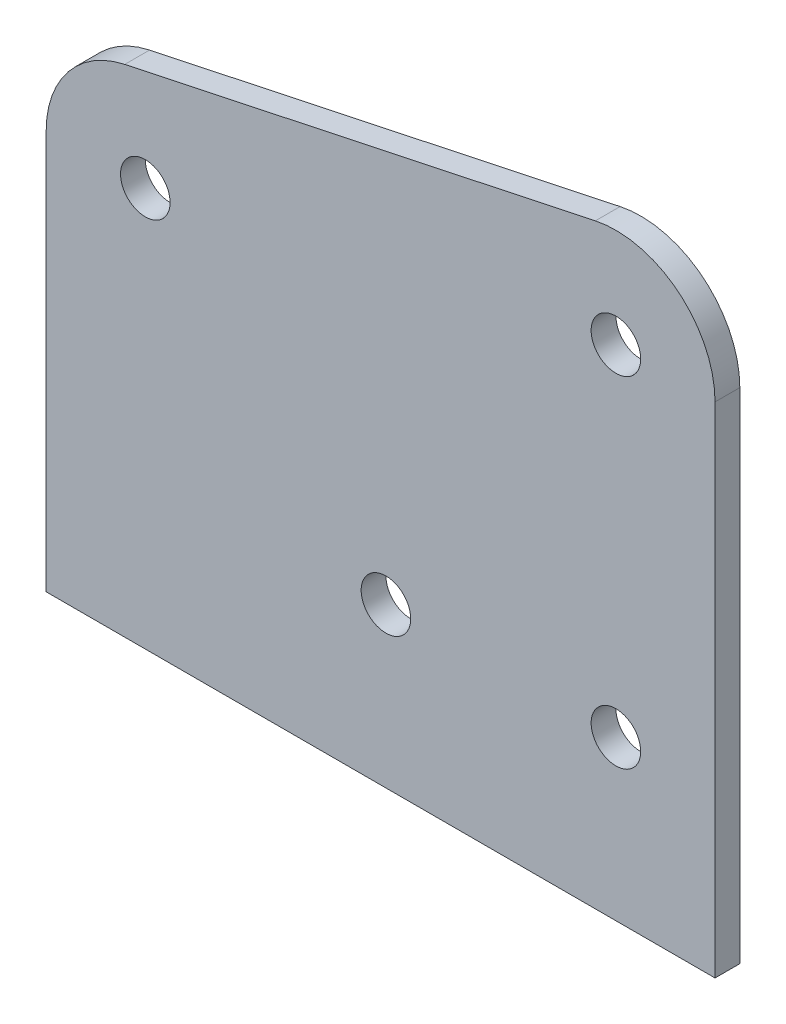
ISO-10303-21;
HEADER;
FILE_DESCRIPTION(('STEP AP214'),'2;1');
FILE_NAME('part.step','',(''),(''),'','','');
FILE_SCHEMA(('AUTOMOTIVE_DESIGN { 1 0 10303 214 1 1 1 1 }'));
ENDSEC;
DATA;
#1=APPLICATION_CONTEXT('core data for automotive mechanical design processes');
#2=APPLICATION_PROTOCOL_DEFINITION('international standard','automotive_design',2000,#1);
#3=PRODUCT_CONTEXT('',#1,'mechanical');
#4=PRODUCT('Part','Part','',(#3));
#5=PRODUCT_RELATED_PRODUCT_CATEGORY('part','',(#4));
#6=PRODUCT_DEFINITION_FORMATION('','',#4);
#7=PRODUCT_DEFINITION_CONTEXT('part definition',#1,'design');
#8=PRODUCT_DEFINITION('design','',#6,#7);
#9=PRODUCT_DEFINITION_SHAPE('','',#8);
#10=(LENGTH_UNIT() NAMED_UNIT(*) SI_UNIT(.MILLI.,.METRE.));
#11=(NAMED_UNIT(*) PLANE_ANGLE_UNIT() SI_UNIT($,.RADIAN.));
#12=(NAMED_UNIT(*) SI_UNIT($,.STERADIAN.) SOLID_ANGLE_UNIT());
#13=UNCERTAINTY_MEASURE_WITH_UNIT(LENGTH_MEASURE(1.E-05),#10,'distance_accuracy_value','');
#14=(GEOMETRIC_REPRESENTATION_CONTEXT(3) GLOBAL_UNCERTAINTY_ASSIGNED_CONTEXT((#13)) GLOBAL_UNIT_ASSIGNED_CONTEXT((#10,
#11,#12)) REPRESENTATION_CONTEXT('',''));
#15=CARTESIAN_POINT('',(0.,0.,0.));
#16=DIRECTION('',(0.,0.,1.));
#17=DIRECTION('',(1.,0.,0.));
#18=AXIS2_PLACEMENT_3D('',#15,#16,#17);
#19=CARTESIAN_POINT('',(20.6876756424581,63.91783,3.175));
#20=DIRECTION('',(0.,0.,1.));
#21=DIRECTION('',(1.,0.,0.));
#22=AXIS2_PLACEMENT_3D('',#19,#20,#21);
#23=PLANE('',#22);
#24=CARTESIAN_POINT('',(-8.77632435754189,20.35683,3.175));
#25=DIRECTION('',(0.,0.,1.));
#26=DIRECTION('',(1.,0.,0.));
#27=AXIS2_PLACEMENT_3D('',#24,#25,#26);
#28=CIRCLE('',#27,3.175);
#29=CARTESIAN_POINT('',(-5.60132435754189,20.35683,3.175));
#30=VERTEX_POINT('',#29);
#31=EDGE_CURVE('E216',#30,#30,#28,.T.);
#32=ORIENTED_EDGE('',*,*,#31,.F.);
#33=EDGE_LOOP('',(#32));
#34=FACE_BOUND('',#33,.T.);
#35=CARTESIAN_POINT('',(20.6876756424581,20.35683,3.175));
#36=DIRECTION('',(0.,0.,1.));
#37=DIRECTION('',(1.,0.,0.));
#38=AXIS2_PLACEMENT_3D('',#35,#36,#37);
#39=CIRCLE('',#38,3.175);
#40=CARTESIAN_POINT('',(23.8626756424581,20.35683,3.175));
#41=VERTEX_POINT('',#40);
#42=EDGE_CURVE('E138',#41,#41,#39,.T.);
#43=ORIENTED_EDGE('',*,*,#42,.F.);
#44=EDGE_LOOP('',(#43));
#45=FACE_BOUND('',#44,.T.);
#46=CARTESIAN_POINT('',(20.6876756424581,63.91783,3.175));
#47=DIRECTION('',(0.,0.,1.));
#48=DIRECTION('',(1.,0.,0.));
#49=AXIS2_PLACEMENT_3D('',#46,#47,#48);
#50=CIRCLE('',#49,12.7);
#51=CARTESIAN_POINT('',(33.3876756424581,63.91783,3.175));
#52=VERTEX_POINT('',#51);
#53=CARTESIAN_POINT('',(18.0529367853964,76.3415231367081,3.175));
#54=VERTEX_POINT('',#53);
#55=EDGE_CURVE('E150',#52,#54,#50,.T.);
#56=ORIENTED_EDGE('',*,*,#55,.T.);
#57=DIRECTION('',(-0.978243554071508,-0.207459752524545,0.));
#58=VECTOR('',#57,1.);
#59=CARTESIAN_POINT('',(18.0529367853964,76.3415231367081,3.175));
#60=LINE('',#59,#58);
#61=CARTESIAN_POINT('',(-42.2403132146036,63.5549091367081,3.175));
#62=VERTEX_POINT('',#61);
#63=EDGE_CURVE('E98',#54,#62,#60,.T.);
#64=ORIENTED_EDGE('',*,*,#63,.T.);
#65=CARTESIAN_POINT('',(-39.6055743575419,51.131216,3.175));
#66=DIRECTION('',(0.,0.,1.));
#67=DIRECTION('',(1.,0.,0.));
#68=AXIS2_PLACEMENT_3D('',#65,#66,#67);
#69=CIRCLE('',#68,12.7);
#70=CARTESIAN_POINT('',(-52.3055743575419,51.131216,3.175));
#71=VERTEX_POINT('',#70);
#72=EDGE_CURVE('E111',#62,#71,#69,.T.);
#73=ORIENTED_EDGE('',*,*,#72,.T.);
#74=DIRECTION('',(0.,-1.,0.));
#75=VECTOR('',#74,1.);
#76=CARTESIAN_POINT('',(-52.3055743575419,51.131216,3.175));
#77=LINE('',#76,#75);
#78=CARTESIAN_POINT('',(-52.3055743575419,0.,3.175));
#79=VERTEX_POINT('',#78);
#80=EDGE_CURVE('E105',#71,#79,#77,.T.);
#81=ORIENTED_EDGE('',*,*,#80,.T.);
#82=DIRECTION('',(1.,0.,0.));
#83=VECTOR('',#82,1.);
#84=CARTESIAN_POINT('',(-52.3055743575419,0.,3.175));
#85=LINE('',#84,#83);
#86=CARTESIAN_POINT('',(33.3876756424581,0.,3.175));
#87=VERTEX_POINT('',#86);
#88=EDGE_CURVE('E109',#79,#87,#85,.T.);
#89=ORIENTED_EDGE('',*,*,#88,.T.);
#90=DIRECTION('',(0.,1.,0.));
#91=VECTOR('',#90,1.);
#92=CARTESIAN_POINT('',(33.3876756424581,63.91783,3.175));
#93=LINE('',#92,#91);
#94=EDGE_CURVE('E61',#87,#52,#93,.T.);
#95=ORIENTED_EDGE('',*,*,#94,.T.);
#96=EDGE_LOOP('',(#56,#64,#73,#81,#89,#95));
#97=FACE_BOUND('',#96,.T.);
#98=CARTESIAN_POINT('',(20.6876756424581,63.91783,3.175));
#99=DIRECTION('',(0.,0.,1.));
#100=DIRECTION('',(1.,0.,0.));
#101=AXIS2_PLACEMENT_3D('',#98,#99,#100);
#102=CIRCLE('',#101,3.175);
#103=CARTESIAN_POINT('',(23.8626756424581,63.91783,3.175));
#104=VERTEX_POINT('',#103);
#105=EDGE_CURVE('E224',#104,#104,#102,.T.);
#106=ORIENTED_EDGE('',*,*,#105,.F.);
#107=EDGE_LOOP('',(#106));
#108=FACE_BOUND('',#107,.T.);
#109=CARTESIAN_POINT('',(-39.6055743575419,51.131216,3.175));
#110=DIRECTION('',(0.,0.,1.));
#111=DIRECTION('',(1.,0.,0.));
#112=AXIS2_PLACEMENT_3D('',#109,#110,#111);
#113=CIRCLE('',#112,3.175);
#114=CARTESIAN_POINT('',(-36.4305743575419,51.131216,3.175));
#115=VERTEX_POINT('',#114);
#116=EDGE_CURVE('E205',#115,#115,#113,.T.);
#117=ORIENTED_EDGE('',*,*,#116,.F.);
#118=EDGE_LOOP('',(#117));
#119=FACE_BOUND('',#118,.T.);
#120=ADVANCED_FACE('F43',(#34,#45,#97,#108,#119),#23,.T.);
#121=CARTESIAN_POINT('',(20.6876756424581,63.91783,0.));
#122=DIRECTION('',(0.,0.,1.));
#123=DIRECTION('',(1.,0.,0.));
#124=AXIS2_PLACEMENT_3D('',#121,#122,#123);
#125=PLANE('',#124);
#126=CARTESIAN_POINT('',(20.6876756424581,63.91783,0.));
#127=DIRECTION('',(0.,0.,1.));
#128=DIRECTION('',(1.,0.,0.));
#129=AXIS2_PLACEMENT_3D('',#126,#127,#128);
#130=CIRCLE('',#129,12.7);
#131=CARTESIAN_POINT('',(33.3876756424581,63.91783,0.));
#132=VERTEX_POINT('',#131);
#133=CARTESIAN_POINT('',(18.0529367853964,76.3415231367081,0.));
#134=VERTEX_POINT('',#133);
#135=EDGE_CURVE('E133',#132,#134,#130,.T.);
#136=ORIENTED_EDGE('',*,*,#135,.F.);
#137=DIRECTION('',(0.,1.,0.));
#138=VECTOR('',#137,1.);
#139=CARTESIAN_POINT('',(33.3876756424581,63.91783,0.));
#140=LINE('',#139,#138);
#141=CARTESIAN_POINT('',(33.3876756424581,0.,0.));
#142=VERTEX_POINT('',#141);
#143=EDGE_CURVE('E90',#142,#132,#140,.T.);
#144=ORIENTED_EDGE('',*,*,#143,.F.);
#145=DIRECTION('',(1.,0.,0.));
#146=VECTOR('',#145,1.);
#147=CARTESIAN_POINT('',(-52.3055743575419,0.,0.));
#148=LINE('',#147,#146);
#149=CARTESIAN_POINT('',(-52.3055743575419,0.,0.));
#150=VERTEX_POINT('',#149);
#151=EDGE_CURVE('E84',#150,#142,#148,.T.);
#152=ORIENTED_EDGE('',*,*,#151,.F.);
#153=DIRECTION('',(0.,-1.,0.));
#154=VECTOR('',#153,1.);
#155=CARTESIAN_POINT('',(-52.3055743575419,51.131216,0.));
#156=LINE('',#155,#154);
#157=CARTESIAN_POINT('',(-52.3055743575419,51.131216,0.));
#158=VERTEX_POINT('',#157);
#159=EDGE_CURVE('E120',#158,#150,#156,.T.);
#160=ORIENTED_EDGE('',*,*,#159,.F.);
#161=CARTESIAN_POINT('',(-39.6055743575419,51.131216,0.));
#162=DIRECTION('',(0.,0.,1.));
#163=DIRECTION('',(1.,0.,0.));
#164=AXIS2_PLACEMENT_3D('',#161,#162,#163);
#165=CIRCLE('',#164,12.7);
#166=CARTESIAN_POINT('',(-42.2403132146036,63.5549091367081,0.));
#167=VERTEX_POINT('',#166);
#168=EDGE_CURVE('E141',#167,#158,#165,.T.);
#169=ORIENTED_EDGE('',*,*,#168,.F.);
#170=DIRECTION('',(-0.978243554071508,-0.207459752524545,0.));
#171=VECTOR('',#170,1.);
#172=CARTESIAN_POINT('',(18.0529367853964,76.3415231367081,0.));
#173=LINE('',#172,#171);
#174=EDGE_CURVE('E137',#134,#167,#173,.T.);
#175=ORIENTED_EDGE('',*,*,#174,.F.);
#176=EDGE_LOOP('',(#136,#144,#152,#160,#169,#175));
#177=FACE_BOUND('',#176,.T.);
#178=CARTESIAN_POINT('',(20.6876756424581,20.35683,0.));
#179=DIRECTION('',(0.,0.,1.));
#180=DIRECTION('',(1.,0.,0.));
#181=AXIS2_PLACEMENT_3D('',#178,#179,#180);
#182=CIRCLE('',#181,3.175);
#183=CARTESIAN_POINT('',(23.8626756424581,20.35683,0.));
#184=VERTEX_POINT('',#183);
#185=EDGE_CURVE('E228',#184,#184,#182,.T.);
#186=ORIENTED_EDGE('',*,*,#185,.T.);
#187=EDGE_LOOP('',(#186));
#188=FACE_BOUND('',#187,.T.);
#189=CARTESIAN_POINT('',(20.6876756424581,63.91783,0.));
#190=DIRECTION('',(0.,0.,1.));
#191=DIRECTION('',(1.,0.,0.));
#192=AXIS2_PLACEMENT_3D('',#189,#190,#191);
#193=CIRCLE('',#192,3.175);
#194=CARTESIAN_POINT('',(23.8626756424581,63.91783,0.));
#195=VERTEX_POINT('',#194);
#196=EDGE_CURVE('E220',#195,#195,#193,.T.);
#197=ORIENTED_EDGE('',*,*,#196,.T.);
#198=EDGE_LOOP('',(#197));
#199=FACE_BOUND('',#198,.T.);
#200=CARTESIAN_POINT('',(-8.77632435754189,20.35683,0.));
#201=DIRECTION('',(0.,0.,1.));
#202=DIRECTION('',(1.,0.,0.));
#203=AXIS2_PLACEMENT_3D('',#200,#201,#202);
#204=CIRCLE('',#203,3.175);
#205=CARTESIAN_POINT('',(-5.60132435754189,20.35683,0.));
#206=VERTEX_POINT('',#205);
#207=EDGE_CURVE('E213',#206,#206,#204,.T.);
#208=ORIENTED_EDGE('',*,*,#207,.T.);
#209=EDGE_LOOP('',(#208));
#210=FACE_BOUND('',#209,.T.);
#211=CARTESIAN_POINT('',(-39.6055743575419,51.131216,0.));
#212=DIRECTION('',(0.,0.,1.));
#213=DIRECTION('',(1.,0.,0.));
#214=AXIS2_PLACEMENT_3D('',#211,#212,#213);
#215=CIRCLE('',#214,3.175);
#216=CARTESIAN_POINT('',(-36.4305743575419,51.131216,0.));
#217=VERTEX_POINT('',#216);
#218=EDGE_CURVE('E208',#217,#217,#215,.T.);
#219=ORIENTED_EDGE('',*,*,#218,.T.);
#220=EDGE_LOOP('',(#219));
#221=FACE_BOUND('',#220,.T.);
#222=ADVANCED_FACE('F163',(#177,#188,#199,#210,#221),#125,.F.);
#223=CARTESIAN_POINT('',(20.6876756424581,63.91783,3.175));
#224=DIRECTION('',(0.,0.,-1.));
#225=DIRECTION('',(-1.,0.,0.));
#226=AXIS2_PLACEMENT_3D('',#223,#224,#225);
#227=CYLINDRICAL_SURFACE('',#226,12.7);
#228=ORIENTED_EDGE('',*,*,#135,.T.);
#229=DIRECTION('',(0.,0.,-1.));
#230=VECTOR('',#229,1.);
#231=CARTESIAN_POINT('',(18.0529367853964,76.3415231367081,3.175));
#232=LINE('',#231,#230);
#233=EDGE_CURVE('E11',#54,#134,#232,.T.);
#234=ORIENTED_EDGE('',*,*,#233,.F.);
#235=ORIENTED_EDGE('',*,*,#55,.F.);
#236=DIRECTION('',(0.,0.,-1.));
#237=VECTOR('',#236,1.);
#238=CARTESIAN_POINT('',(33.3876756424581,63.91783,3.175));
#239=LINE('',#238,#237);
#240=EDGE_CURVE('E129',#52,#132,#239,.T.);
#241=ORIENTED_EDGE('',*,*,#240,.T.);
#242=EDGE_LOOP('',(#228,#234,#235,#241));
#243=FACE_BOUND('',#242,.T.);
#244=ADVANCED_FACE('F45',(#243),#227,.T.);
#245=CARTESIAN_POINT('',(18.0529367853964,76.3415231367081,3.175));
#246=DIRECTION('',(0.207459752524545,-0.978243554071508,0.));
#247=DIRECTION('',(0.978243554071508,0.207459752524545,0.));
#248=AXIS2_PLACEMENT_3D('',#245,#246,#247);
#249=PLANE('',#248);
#250=ORIENTED_EDGE('',*,*,#174,.T.);
#251=DIRECTION('',(0.,0.,-1.));
#252=VECTOR('',#251,1.);
#253=CARTESIAN_POINT('',(-42.2403132146036,63.5549091367081,3.175));
#254=LINE('',#253,#252);
#255=EDGE_CURVE('E53',#62,#167,#254,.T.);
#256=ORIENTED_EDGE('',*,*,#255,.F.);
#257=ORIENTED_EDGE('',*,*,#63,.F.);
#258=ORIENTED_EDGE('',*,*,#233,.T.);
#259=EDGE_LOOP('',(#250,#256,#257,#258));
#260=FACE_BOUND('',#259,.T.);
#261=ADVANCED_FACE('F296',(#260),#249,.F.);
#262=CARTESIAN_POINT('',(-39.6055743575419,51.131216,3.175));
#263=DIRECTION('',(0.,0.,-1.));
#264=DIRECTION('',(-1.,0.,0.));
#265=AXIS2_PLACEMENT_3D('',#262,#263,#264);
#266=CYLINDRICAL_SURFACE('',#265,12.7);
#267=ORIENTED_EDGE('',*,*,#168,.T.);
#268=DIRECTION('',(0.,0.,-1.));
#269=VECTOR('',#268,1.);
#270=CARTESIAN_POINT('',(-52.3055743575419,51.131216,3.175));
#271=LINE('',#270,#269);
#272=EDGE_CURVE('E122',#71,#158,#271,.T.);
#273=ORIENTED_EDGE('',*,*,#272,.F.);
#274=ORIENTED_EDGE('',*,*,#72,.F.);
#275=ORIENTED_EDGE('',*,*,#255,.T.);
#276=EDGE_LOOP('',(#267,#273,#274,#275));
#277=FACE_BOUND('',#276,.T.);
#278=ADVANCED_FACE('F160',(#277),#266,.T.);
#279=CARTESIAN_POINT('',(-52.3055743575419,51.131216,3.175));
#280=DIRECTION('',(1.,0.,0.));
#281=DIRECTION('',(0.,0.,-1.));
#282=AXIS2_PLACEMENT_3D('',#279,#280,#281);
#283=PLANE('',#282);
#284=ORIENTED_EDGE('',*,*,#159,.T.);
#285=DIRECTION('',(0.,0.,-1.));
#286=VECTOR('',#285,1.);
#287=CARTESIAN_POINT('',(-52.3055743575419,0.,3.175));
#288=LINE('',#287,#286);
#289=EDGE_CURVE('E117',#79,#150,#288,.T.);
#290=ORIENTED_EDGE('',*,*,#289,.F.);
#291=ORIENTED_EDGE('',*,*,#80,.F.);
#292=ORIENTED_EDGE('',*,*,#272,.T.);
#293=EDGE_LOOP('',(#284,#290,#291,#292));
#294=FACE_BOUND('',#293,.T.);
#295=ADVANCED_FACE('F118',(#294),#283,.F.);
#296=CARTESIAN_POINT('',(-52.3055743575419,0.,3.175));
#297=DIRECTION('',(0.,1.,0.));
#298=DIRECTION('',(0.,0.,1.));
#299=AXIS2_PLACEMENT_3D('',#296,#297,#298);
#300=PLANE('',#299);
#301=ORIENTED_EDGE('',*,*,#151,.T.);
#302=DIRECTION('',(0.,0.,-1.));
#303=VECTOR('',#302,1.);
#304=CARTESIAN_POINT('',(33.3876756424581,0.,3.175));
#305=LINE('',#304,#303);
#306=EDGE_CURVE('E123',#87,#142,#305,.T.);
#307=ORIENTED_EDGE('',*,*,#306,.F.);
#308=ORIENTED_EDGE('',*,*,#88,.F.);
#309=ORIENTED_EDGE('',*,*,#289,.T.);
#310=EDGE_LOOP('',(#301,#307,#308,#309));
#311=FACE_BOUND('',#310,.T.);
#312=ADVANCED_FACE('F125',(#311),#300,.F.);
#313=CARTESIAN_POINT('',(33.3876756424581,63.91783,3.175));
#314=DIRECTION('',(-1.,0.,0.));
#315=DIRECTION('',(0.,0.,1.));
#316=AXIS2_PLACEMENT_3D('',#313,#314,#315);
#317=PLANE('',#316);
#318=ORIENTED_EDGE('',*,*,#143,.T.);
#319=ORIENTED_EDGE('',*,*,#240,.F.);
#320=ORIENTED_EDGE('',*,*,#94,.F.);
#321=ORIENTED_EDGE('',*,*,#306,.T.);
#322=EDGE_LOOP('',(#318,#319,#320,#321));
#323=FACE_BOUND('',#322,.T.);
#324=ADVANCED_FACE('F168',(#323),#317,.F.);
#325=CARTESIAN_POINT('',(20.6876756424581,20.35683,3.175));
#326=DIRECTION('',(0.,0.,-1.));
#327=DIRECTION('',(-1.,0.,0.));
#328=AXIS2_PLACEMENT_3D('',#325,#326,#327);
#329=CYLINDRICAL_SURFACE('',#328,3.175);
#330=ORIENTED_EDGE('',*,*,#42,.T.);
#331=EDGE_LOOP('',(#330));
#332=FACE_BOUND('',#331,.T.);
#333=ORIENTED_EDGE('',*,*,#185,.F.);
#334=EDGE_LOOP('',(#333));
#335=FACE_BOUND('',#334,.T.);
#336=ADVANCED_FACE('F170',(#332,#335),#329,.F.);
#337=CARTESIAN_POINT('',(20.6876756424581,63.91783,3.175));
#338=DIRECTION('',(0.,0.,-1.));
#339=DIRECTION('',(-1.,0.,0.));
#340=AXIS2_PLACEMENT_3D('',#337,#338,#339);
#341=CYLINDRICAL_SURFACE('',#340,3.175);
#342=ORIENTED_EDGE('',*,*,#105,.T.);
#343=EDGE_LOOP('',(#342));
#344=FACE_BOUND('',#343,.T.);
#345=ORIENTED_EDGE('',*,*,#196,.F.);
#346=EDGE_LOOP('',(#345));
#347=FACE_BOUND('',#346,.T.);
#348=ADVANCED_FACE('F176',(#344,#347),#341,.F.);
#349=CARTESIAN_POINT('',(-8.77632435754189,20.35683,3.175));
#350=DIRECTION('',(0.,0.,-1.));
#351=DIRECTION('',(-1.,0.,0.));
#352=AXIS2_PLACEMENT_3D('',#349,#350,#351);
#353=CYLINDRICAL_SURFACE('',#352,3.175);
#354=ORIENTED_EDGE('',*,*,#31,.T.);
#355=EDGE_LOOP('',(#354));
#356=FACE_BOUND('',#355,.T.);
#357=ORIENTED_EDGE('',*,*,#207,.F.);
#358=EDGE_LOOP('',(#357));
#359=FACE_BOUND('',#358,.T.);
#360=ADVANCED_FACE('F192',(#356,#359),#353,.F.);
#361=CARTESIAN_POINT('',(-39.6055743575419,51.131216,3.175));
#362=DIRECTION('',(0.,0.,-1.));
#363=DIRECTION('',(-1.,0.,0.));
#364=AXIS2_PLACEMENT_3D('',#361,#362,#363);
#365=CYLINDRICAL_SURFACE('',#364,3.175);
#366=ORIENTED_EDGE('',*,*,#116,.T.);
#367=EDGE_LOOP('',(#366));
#368=FACE_BOUND('',#367,.T.);
#369=ORIENTED_EDGE('',*,*,#218,.F.);
#370=EDGE_LOOP('',(#369));
#371=FACE_BOUND('',#370,.T.);
#372=ADVANCED_FACE('F196',(#368,#371),#365,.F.);
#373=CLOSED_SHELL('',(#120,#222,#244,#261,#278,#295,#312,#324,#336,#348,#360,#372));
#374=MANIFOLD_SOLID_BREP('B2',#373);
#375=ADVANCED_BREP_SHAPE_REPRESENTATION('',(#18,#374),#14);
#376=SHAPE_DEFINITION_REPRESENTATION(#9,#375);
ENDSEC;
END-ISO-10303-21;
